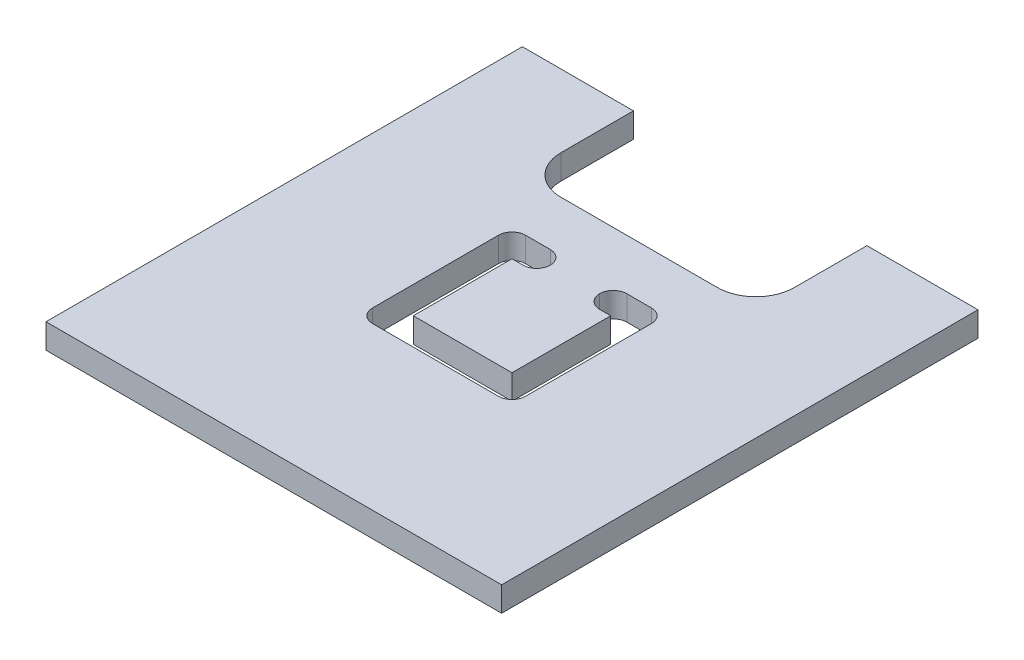
ISO-10303-21;
HEADER;
FILE_DESCRIPTION(('STEP AP214'),'2;1');
FILE_NAME('part.step','',(''),(''),'','','');
FILE_SCHEMA(('AUTOMOTIVE_DESIGN { 1 0 10303 214 1 1 1 1 }'));
ENDSEC;
DATA;
#1=APPLICATION_CONTEXT('core data for automotive mechanical design processes');
#2=APPLICATION_PROTOCOL_DEFINITION('international standard','automotive_design',2000,#1);
#3=PRODUCT_CONTEXT('',#1,'mechanical');
#4=PRODUCT('Part','Part','',(#3));
#5=PRODUCT_RELATED_PRODUCT_CATEGORY('part','',(#4));
#6=PRODUCT_DEFINITION_FORMATION('','',#4);
#7=PRODUCT_DEFINITION_CONTEXT('part definition',#1,'design');
#8=PRODUCT_DEFINITION('design','',#6,#7);
#9=PRODUCT_DEFINITION_SHAPE('','',#8);
#10=(LENGTH_UNIT() NAMED_UNIT(*) SI_UNIT(.MILLI.,.METRE.));
#11=(NAMED_UNIT(*) PLANE_ANGLE_UNIT() SI_UNIT($,.RADIAN.));
#12=(NAMED_UNIT(*) SI_UNIT($,.STERADIAN.) SOLID_ANGLE_UNIT());
#13=UNCERTAINTY_MEASURE_WITH_UNIT(LENGTH_MEASURE(1.E-05),#10,'distance_accuracy_value','');
#14=(GEOMETRIC_REPRESENTATION_CONTEXT(3) GLOBAL_UNCERTAINTY_ASSIGNED_CONTEXT((#13)) GLOBAL_UNIT_ASSIGNED_CONTEXT((#10,
#11,#12)) REPRESENTATION_CONTEXT('',''));
#15=CARTESIAN_POINT('',(0.,0.,0.));
#16=DIRECTION('',(0.,0.,1.));
#17=DIRECTION('',(1.,0.,0.));
#18=AXIS2_PLACEMENT_3D('',#15,#16,#17);
#19=CARTESIAN_POINT('',(-9.23,1.,-9.65));
#20=DIRECTION('',(0.,0.,1.));
#21=DIRECTION('',(1.,0.,0.));
#22=AXIS2_PLACEMENT_3D('',#19,#20,#21);
#23=PLANE('',#22);
#24=DIRECTION('',(-1.,0.,0.));
#25=VECTOR('',#24,1.);
#26=CARTESIAN_POINT('',(-9.23,0.,-9.65));
#27=LINE('',#26,#25);
#28=CARTESIAN_POINT('',(9.23,0.,-9.65));
#29=VERTEX_POINT('',#28);
#30=CARTESIAN_POINT('',(4.72999999999999,0.,-9.65));
#31=VERTEX_POINT('',#30);
#32=EDGE_CURVE('E340',#29,#31,#27,.T.);
#33=ORIENTED_EDGE('',*,*,#32,.T.);
#34=DIRECTION('',(0.,-1.,0.));
#35=VECTOR('',#34,1.);
#36=CARTESIAN_POINT('',(4.72999999999999,1.,-9.65));
#37=LINE('',#36,#35);
#38=CARTESIAN_POINT('',(4.72999999999999,1.,-9.65));
#39=VERTEX_POINT('',#38);
#40=EDGE_CURVE('E319',#39,#31,#37,.T.);
#41=ORIENTED_EDGE('',*,*,#40,.F.);
#42=DIRECTION('',(-1.,0.,0.));
#43=VECTOR('',#42,1.);
#44=CARTESIAN_POINT('',(-9.23,1.,-9.65));
#45=LINE('',#44,#43);
#46=CARTESIAN_POINT('',(9.23,1.,-9.65));
#47=VERTEX_POINT('',#46);
#48=EDGE_CURVE('E329',#47,#39,#45,.T.);
#49=ORIENTED_EDGE('',*,*,#48,.F.);
#50=DIRECTION('',(0.,-1.,0.));
#51=VECTOR('',#50,1.);
#52=CARTESIAN_POINT('',(9.23,1.,-9.65));
#53=LINE('',#52,#51);
#54=EDGE_CURVE('E354',#47,#29,#53,.T.);
#55=ORIENTED_EDGE('',*,*,#54,.T.);
#56=EDGE_LOOP('',(#33,#41,#49,#55));
#57=FACE_BOUND('',#56,.T.);
#58=ADVANCED_FACE('F35',(#57),#23,.F.);
#59=CARTESIAN_POINT('',(9.23,1.,9.65));
#60=DIRECTION('',(-1.,0.,0.));
#61=DIRECTION('',(0.,0.,1.));
#62=AXIS2_PLACEMENT_3D('',#59,#60,#61);
#63=PLANE('',#62);
#64=DIRECTION('',(0.,0.,-1.));
#65=VECTOR('',#64,1.);
#66=CARTESIAN_POINT('',(9.23,0.,9.65));
#67=LINE('',#66,#65);
#68=CARTESIAN_POINT('',(9.23,0.,9.65));
#69=VERTEX_POINT('',#68);
#70=EDGE_CURVE('E321',#69,#29,#67,.T.);
#71=ORIENTED_EDGE('',*,*,#70,.T.);
#72=ORIENTED_EDGE('',*,*,#54,.F.);
#73=DIRECTION('',(0.,0.,-1.));
#74=VECTOR('',#73,1.);
#75=CARTESIAN_POINT('',(9.23,1.,9.65));
#76=LINE('',#75,#74);
#77=CARTESIAN_POINT('',(9.23,1.,9.65));
#78=VERTEX_POINT('',#77);
#79=EDGE_CURVE('E324',#78,#47,#76,.T.);
#80=ORIENTED_EDGE('',*,*,#79,.F.);
#81=DIRECTION('',(0.,-1.,0.));
#82=VECTOR('',#81,1.);
#83=CARTESIAN_POINT('',(9.23,1.,9.65));
#84=LINE('',#83,#82);
#85=EDGE_CURVE('E336',#78,#69,#84,.T.);
#86=ORIENTED_EDGE('',*,*,#85,.T.);
#87=EDGE_LOOP('',(#71,#72,#80,#86));
#88=FACE_BOUND('',#87,.T.);
#89=ADVANCED_FACE('F507',(#88),#63,.F.);
#90=CARTESIAN_POINT('',(-4.72999999999999,1.,-9.65));
#91=VERTEX_POINT('',#90);
#92=CARTESIAN_POINT('',(-9.23,1.,-9.65));
#93=VERTEX_POINT('',#92);
#94=EDGE_CURVE('E327',#91,#93,#45,.T.);
#95=ORIENTED_EDGE('',*,*,#94,.F.);
#96=DIRECTION('',(0.,-1.,0.));
#97=VECTOR('',#96,1.);
#98=CARTESIAN_POINT('',(-4.72999999999999,1.,-9.65));
#99=LINE('',#98,#97);
#100=CARTESIAN_POINT('',(-4.72999999999999,0.,-9.65));
#101=VERTEX_POINT('',#100);
#102=EDGE_CURVE('E312',#91,#101,#99,.T.);
#103=ORIENTED_EDGE('',*,*,#102,.T.);
#104=CARTESIAN_POINT('',(-9.23,0.,-9.65));
#105=VERTEX_POINT('',#104);
#106=EDGE_CURVE('E339',#101,#105,#27,.T.);
#107=ORIENTED_EDGE('',*,*,#106,.T.);
#108=DIRECTION('',(0.,-1.,0.));
#109=VECTOR('',#108,1.);
#110=CARTESIAN_POINT('',(-9.23,1.,-9.65));
#111=LINE('',#110,#109);
#112=EDGE_CURVE('E351',#93,#105,#111,.T.);
#113=ORIENTED_EDGE('',*,*,#112,.F.);
#114=EDGE_LOOP('',(#95,#103,#107,#113));
#115=FACE_BOUND('',#114,.T.);
#116=ADVANCED_FACE('F510',(#115),#23,.F.);
#117=CARTESIAN_POINT('',(-9.23,1.,9.65));
#118=DIRECTION('',(1.,0.,0.));
#119=DIRECTION('',(0.,0.,-1.));
#120=AXIS2_PLACEMENT_3D('',#117,#118,#119);
#121=PLANE('',#120);
#122=DIRECTION('',(0.,0.,1.));
#123=VECTOR('',#122,1.);
#124=CARTESIAN_POINT('',(-9.23,0.,9.65));
#125=LINE('',#124,#123);
#126=CARTESIAN_POINT('',(-9.23,0.,9.65));
#127=VERTEX_POINT('',#126);
#128=EDGE_CURVE('E343',#105,#127,#125,.T.);
#129=ORIENTED_EDGE('',*,*,#128,.T.);
#130=DIRECTION('',(0.,-1.,0.));
#131=VECTOR('',#130,1.);
#132=CARTESIAN_POINT('',(-9.23,1.,9.65));
#133=LINE('',#132,#131);
#134=CARTESIAN_POINT('',(-9.23,1.,9.65));
#135=VERTEX_POINT('',#134);
#136=EDGE_CURVE('E348',#135,#127,#133,.T.);
#137=ORIENTED_EDGE('',*,*,#136,.F.);
#138=DIRECTION('',(0.,0.,1.));
#139=VECTOR('',#138,1.);
#140=CARTESIAN_POINT('',(-9.23,1.,9.65));
#141=LINE('',#140,#139);
#142=EDGE_CURVE('E332',#93,#135,#141,.T.);
#143=ORIENTED_EDGE('',*,*,#142,.F.);
#144=ORIENTED_EDGE('',*,*,#112,.T.);
#145=EDGE_LOOP('',(#129,#137,#143,#144));
#146=FACE_BOUND('',#145,.T.);
#147=ADVANCED_FACE('F518',(#146),#121,.F.);
#148=CARTESIAN_POINT('',(-9.23,1.,9.65));
#149=DIRECTION('',(0.,0.,-1.));
#150=DIRECTION('',(-1.,0.,0.));
#151=AXIS2_PLACEMENT_3D('',#148,#149,#150);
#152=PLANE('',#151);
#153=DIRECTION('',(1.,0.,0.));
#154=VECTOR('',#153,1.);
#155=CARTESIAN_POINT('',(-9.23,0.,9.65));
#156=LINE('',#155,#154);
#157=EDGE_CURVE('E328',#127,#69,#156,.T.);
#158=ORIENTED_EDGE('',*,*,#157,.T.);
#159=ORIENTED_EDGE('',*,*,#85,.F.);
#160=DIRECTION('',(1.,0.,0.));
#161=VECTOR('',#160,1.);
#162=CARTESIAN_POINT('',(-9.23,1.,9.65));
#163=LINE('',#162,#161);
#164=EDGE_CURVE('E334',#135,#78,#163,.T.);
#165=ORIENTED_EDGE('',*,*,#164,.F.);
#166=ORIENTED_EDGE('',*,*,#136,.T.);
#167=EDGE_LOOP('',(#158,#159,#165,#166));
#168=FACE_BOUND('',#167,.T.);
#169=ADVANCED_FACE('F523',(#168),#152,.F.);
#170=CARTESIAN_POINT('',(0.,1.,0.));
#171=DIRECTION('',(0.,-1.,0.));
#172=DIRECTION('',(0.,0.,-1.));
#173=AXIS2_PLACEMENT_3D('',#170,#171,#172);
#174=PLANE('',#173);
#175=DIRECTION('',(0.,0.,1.));
#176=VECTOR('',#175,1.);
#177=CARTESIAN_POINT('',(2.,1.,2.));
#178=LINE('',#177,#176);
#179=CARTESIAN_POINT('',(2.,1.,-2.));
#180=VERTEX_POINT('',#179);
#181=CARTESIAN_POINT('',(2.,1.,2.));
#182=VERTEX_POINT('',#181);
#183=EDGE_CURVE('E271',#180,#182,#178,.T.);
#184=ORIENTED_EDGE('',*,*,#183,.F.);
#185=DIRECTION('',(1.,0.,0.));
#186=VECTOR('',#185,1.);
#187=CARTESIAN_POINT('',(2.,1.,-2.));
#188=LINE('',#187,#186);
#189=CARTESIAN_POINT('',(1.55,1.,-2.));
#190=VERTEX_POINT('',#189);
#191=EDGE_CURVE('E238',#190,#180,#188,.T.);
#192=ORIENTED_EDGE('',*,*,#191,.F.);
#193=CARTESIAN_POINT('',(1.55,1.,-2.55));
#194=DIRECTION('',(0.,-1.,0.));
#195=DIRECTION('',(0.,0.,-1.));
#196=AXIS2_PLACEMENT_3D('',#193,#194,#195);
#197=CIRCLE('',#196,0.55);
#198=CARTESIAN_POINT('',(1.,1.,-2.55));
#199=VERTEX_POINT('',#198);
#200=EDGE_CURVE('E60',#190,#199,#197,.T.);
#201=ORIENTED_EDGE('',*,*,#200,.T.);
#202=CARTESIAN_POINT('',(1.55,1.,-2.55));
#203=DIRECTION('',(0.,-1.,0.));
#204=DIRECTION('',(0.,0.,-1.));
#205=AXIS2_PLACEMENT_3D('',#202,#203,#204);
#206=CIRCLE('',#205,0.55);
#207=CARTESIAN_POINT('',(1.55,1.,-3.1));
#208=VERTEX_POINT('',#207);
#209=EDGE_CURVE('E422',#199,#208,#206,.T.);
#210=ORIENTED_EDGE('',*,*,#209,.T.);
#211=DIRECTION('',(-1.,0.,0.));
#212=VECTOR('',#211,1.);
#213=CARTESIAN_POINT('',(1.,1.,-3.1));
#214=LINE('',#213,#212);
#215=CARTESIAN_POINT('',(2.55,1.,-3.1));
#216=VERTEX_POINT('',#215);
#217=EDGE_CURVE('E233',#216,#208,#214,.T.);
#218=ORIENTED_EDGE('',*,*,#217,.F.);
#219=CARTESIAN_POINT('',(2.55,1.,-2.55));
#220=DIRECTION('',(0.,-1.,0.));
#221=DIRECTION('',(0.,0.,-1.));
#222=AXIS2_PLACEMENT_3D('',#219,#220,#221);
#223=CIRCLE('',#222,0.55);
#224=CARTESIAN_POINT('',(3.1,1.,-2.55));
#225=VERTEX_POINT('',#224);
#226=EDGE_CURVE('E425',#216,#225,#223,.T.);
#227=ORIENTED_EDGE('',*,*,#226,.T.);
#228=DIRECTION('',(0.,0.,-1.));
#229=VECTOR('',#228,1.);
#230=CARTESIAN_POINT('',(3.1,1.,3.1));
#231=LINE('',#230,#229);
#232=CARTESIAN_POINT('',(3.1,1.,2.55));
#233=VERTEX_POINT('',#232);
#234=EDGE_CURVE('E292',#233,#225,#231,.T.);
#235=ORIENTED_EDGE('',*,*,#234,.F.);
#236=CARTESIAN_POINT('',(2.55,1.,2.55));
#237=DIRECTION('',(0.,-1.,0.));
#238=DIRECTION('',(0.,0.,-1.));
#239=AXIS2_PLACEMENT_3D('',#236,#237,#238);
#240=CIRCLE('',#239,0.55);
#241=CARTESIAN_POINT('',(2.55,1.,3.1));
#242=VERTEX_POINT('',#241);
#243=EDGE_CURVE('E44',#233,#242,#240,.T.);
#244=ORIENTED_EDGE('',*,*,#243,.T.);
#245=DIRECTION('',(1.,0.,0.));
#246=VECTOR('',#245,1.);
#247=CARTESIAN_POINT('',(-3.1,1.,3.1));
#248=LINE('',#247,#246);
#249=CARTESIAN_POINT('',(-2.55,1.,3.1));
#250=VERTEX_POINT('',#249);
#251=EDGE_CURVE('E289',#250,#242,#248,.T.);
#252=ORIENTED_EDGE('',*,*,#251,.F.);
#253=CARTESIAN_POINT('',(-2.55,1.,2.55));
#254=DIRECTION('',(0.,-1.,0.));
#255=DIRECTION('',(0.,0.,-1.));
#256=AXIS2_PLACEMENT_3D('',#253,#254,#255);
#257=CIRCLE('',#256,0.55);
#258=CARTESIAN_POINT('',(-3.1,1.,2.55));
#259=VERTEX_POINT('',#258);
#260=EDGE_CURVE('E410',#250,#259,#257,.T.);
#261=ORIENTED_EDGE('',*,*,#260,.T.);
#262=DIRECTION('',(0.,0.,1.));
#263=VECTOR('',#262,1.);
#264=CARTESIAN_POINT('',(-3.1,1.,3.1));
#265=LINE('',#264,#263);
#266=CARTESIAN_POINT('',(-3.1,1.,-2.55));
#267=VERTEX_POINT('',#266);
#268=EDGE_CURVE('E286',#267,#259,#265,.T.);
#269=ORIENTED_EDGE('',*,*,#268,.F.);
#270=CARTESIAN_POINT('',(-2.55,1.,-2.55));
#271=DIRECTION('',(0.,-1.,0.));
#272=DIRECTION('',(0.,0.,-1.));
#273=AXIS2_PLACEMENT_3D('',#270,#271,#272);
#274=CIRCLE('',#273,0.55);
#275=CARTESIAN_POINT('',(-2.55,1.,-3.1));
#276=VERTEX_POINT('',#275);
#277=EDGE_CURVE('E418',#267,#276,#274,.T.);
#278=ORIENTED_EDGE('',*,*,#277,.T.);
#279=DIRECTION('',(-1.,0.,0.));
#280=VECTOR('',#279,1.);
#281=CARTESIAN_POINT('',(-3.1,1.,-3.1));
#282=LINE('',#281,#280);
#283=CARTESIAN_POINT('',(-1.55,1.,-3.1));
#284=VERTEX_POINT('',#283);
#285=EDGE_CURVE('E283',#284,#276,#282,.T.);
#286=ORIENTED_EDGE('',*,*,#285,.F.);
#287=CARTESIAN_POINT('',(-1.55,1.,-2.55));
#288=DIRECTION('',(0.,-1.,0.));
#289=DIRECTION('',(0.,0.,-1.));
#290=AXIS2_PLACEMENT_3D('',#287,#288,#289);
#291=CIRCLE('',#290,0.55);
#292=CARTESIAN_POINT('',(-1.,1.,-2.55));
#293=VERTEX_POINT('',#292);
#294=EDGE_CURVE('E414',#284,#293,#291,.T.);
#295=ORIENTED_EDGE('',*,*,#294,.T.);
#296=CARTESIAN_POINT('',(-1.55,1.,-2.55));
#297=DIRECTION('',(0.,-1.,0.));
#298=DIRECTION('',(0.,0.,-1.));
#299=AXIS2_PLACEMENT_3D('',#296,#297,#298);
#300=CIRCLE('',#299,0.55);
#301=CARTESIAN_POINT('',(-1.55,1.,-2.));
#302=VERTEX_POINT('',#301);
#303=EDGE_CURVE('E404',#293,#302,#300,.T.);
#304=ORIENTED_EDGE('',*,*,#303,.T.);
#305=DIRECTION('',(1.,0.,0.));
#306=VECTOR('',#305,1.);
#307=CARTESIAN_POINT('',(-2.,1.,-2.));
#308=LINE('',#307,#306);
#309=CARTESIAN_POINT('',(-2.,1.,-2.));
#310=VERTEX_POINT('',#309);
#311=EDGE_CURVE('E280',#310,#302,#308,.T.);
#312=ORIENTED_EDGE('',*,*,#311,.F.);
#313=DIRECTION('',(0.,0.,-1.));
#314=VECTOR('',#313,1.);
#315=CARTESIAN_POINT('',(-2.,1.,2.));
#316=LINE('',#315,#314);
#317=CARTESIAN_POINT('',(-2.,1.,2.));
#318=VERTEX_POINT('',#317);
#319=EDGE_CURVE('E277',#318,#310,#316,.T.);
#320=ORIENTED_EDGE('',*,*,#319,.F.);
#321=DIRECTION('',(-1.,0.,0.));
#322=VECTOR('',#321,1.);
#323=CARTESIAN_POINT('',(-2.,1.,2.));
#324=LINE('',#323,#322);
#325=EDGE_CURVE('E274',#182,#318,#324,.T.);
#326=ORIENTED_EDGE('',*,*,#325,.F.);
#327=EDGE_LOOP('',(#184,#192,#201,#210,#218,#227,#235,#244,#252,#261,#269,#278,#286,#295,#304,
#312,#320,#326));
#328=FACE_BOUND('',#327,.T.);
#329=ORIENTED_EDGE('',*,*,#48,.T.);
#330=DIRECTION('',(0.,0.,1.));
#331=VECTOR('',#330,1.);
#332=CARTESIAN_POINT('',(4.72999999999999,1.,-9.65));
#333=LINE('',#332,#331);
#334=CARTESIAN_POINT('',(4.73,1.,-6.70999999999988));
#335=VERTEX_POINT('',#334);
#336=EDGE_CURVE('E303',#39,#335,#333,.T.);
#337=ORIENTED_EDGE('',*,*,#336,.T.);
#338=CARTESIAN_POINT('',(3.17,1.,-6.70999999999988));
#339=DIRECTION('',(0.,-1.,0.));
#340=DIRECTION('',(0.,0.,-1.));
#341=AXIS2_PLACEMENT_3D('',#338,#339,#340);
#342=CIRCLE('',#341,1.56);
#343=CARTESIAN_POINT('',(3.17,1.,-5.14999999999988));
#344=VERTEX_POINT('',#343);
#345=EDGE_CURVE('E373',#335,#344,#342,.T.);
#346=ORIENTED_EDGE('',*,*,#345,.T.);
#347=DIRECTION('',(-1.,0.,0.));
#348=VECTOR('',#347,1.);
#349=CARTESIAN_POINT('',(4.73,1.,-5.14999999999988));
#350=LINE('',#349,#348);
#351=CARTESIAN_POINT('',(-3.16999999999998,1.,-5.14999999999988));
#352=VERTEX_POINT('',#351);
#353=EDGE_CURVE('E306',#344,#352,#350,.T.);
#354=ORIENTED_EDGE('',*,*,#353,.T.);
#355=CARTESIAN_POINT('',(-3.16999999999998,1.,-6.70999999999988));
#356=DIRECTION('',(0.,-1.,0.));
#357=DIRECTION('',(0.,0.,-1.));
#358=AXIS2_PLACEMENT_3D('',#355,#356,#357);
#359=CIRCLE('',#358,1.56);
#360=CARTESIAN_POINT('',(-4.72999999999998,1.,-6.70999999999988));
#361=VERTEX_POINT('',#360);
#362=EDGE_CURVE('E369',#352,#361,#359,.T.);
#363=ORIENTED_EDGE('',*,*,#362,.T.);
#364=DIRECTION('',(0.,0.,-1.));
#365=VECTOR('',#364,1.);
#366=CARTESIAN_POINT('',(-4.72999999999999,1.,-9.65));
#367=LINE('',#366,#365);
#368=EDGE_CURVE('E310',#361,#91,#367,.T.);
#369=ORIENTED_EDGE('',*,*,#368,.T.);
#370=ORIENTED_EDGE('',*,*,#94,.T.);
#371=ORIENTED_EDGE('',*,*,#142,.T.);
#372=ORIENTED_EDGE('',*,*,#164,.T.);
#373=ORIENTED_EDGE('',*,*,#79,.T.);
#374=EDGE_LOOP('',(#329,#337,#346,#354,#363,#369,#370,#371,#372,#373));
#375=FACE_BOUND('',#374,.T.);
#376=ADVANCED_FACE('F440',(#328,#375),#174,.F.);
#377=CARTESIAN_POINT('',(0.,0.,0.));
#378=DIRECTION('',(0.,-1.,0.));
#379=DIRECTION('',(0.,0.,-1.));
#380=AXIS2_PLACEMENT_3D('',#377,#378,#379);
#381=PLANE('',#380);
#382=DIRECTION('',(-1.,0.,0.));
#383=VECTOR('',#382,1.);
#384=CARTESIAN_POINT('',(1.,0.,-3.1));
#385=LINE('',#384,#383);
#386=CARTESIAN_POINT('',(2.55,0.,-3.1));
#387=VERTEX_POINT('',#386);
#388=CARTESIAN_POINT('',(1.55,0.,-3.1));
#389=VERTEX_POINT('',#388);
#390=EDGE_CURVE('E243',#387,#389,#385,.T.);
#391=ORIENTED_EDGE('',*,*,#390,.T.);
#392=CARTESIAN_POINT('',(1.55,0.,-2.55));
#393=DIRECTION('',(0.,-1.,0.));
#394=DIRECTION('',(0.,0.,-1.));
#395=AXIS2_PLACEMENT_3D('',#392,#393,#394);
#396=CIRCLE('',#395,0.55);
#397=CARTESIAN_POINT('',(1.,0.,-2.55));
#398=VERTEX_POINT('',#397);
#399=EDGE_CURVE('E52',#389,#398,#396,.F.);
#400=ORIENTED_EDGE('',*,*,#399,.T.);
#401=CARTESIAN_POINT('',(1.55,0.,-2.55));
#402=DIRECTION('',(0.,-1.,0.));
#403=DIRECTION('',(0.,0.,-1.));
#404=AXIS2_PLACEMENT_3D('',#401,#402,#403);
#405=CIRCLE('',#404,0.55);
#406=CARTESIAN_POINT('',(1.55,0.,-2.));
#407=VERTEX_POINT('',#406);
#408=EDGE_CURVE('E229',#398,#407,#405,.F.);
#409=ORIENTED_EDGE('',*,*,#408,.T.);
#410=DIRECTION('',(1.,0.,0.));
#411=VECTOR('',#410,1.);
#412=CARTESIAN_POINT('',(2.,0.,-2.));
#413=LINE('',#412,#411);
#414=CARTESIAN_POINT('',(2.,0.,-2.));
#415=VERTEX_POINT('',#414);
#416=EDGE_CURVE('E221',#407,#415,#413,.T.);
#417=ORIENTED_EDGE('',*,*,#416,.T.);
#418=DIRECTION('',(0.,0.,1.));
#419=VECTOR('',#418,1.);
#420=CARTESIAN_POINT('',(2.,0.,2.));
#421=LINE('',#420,#419);
#422=CARTESIAN_POINT('',(2.,0.,2.));
#423=VERTEX_POINT('',#422);
#424=EDGE_CURVE('E227',#415,#423,#421,.T.);
#425=ORIENTED_EDGE('',*,*,#424,.T.);
#426=DIRECTION('',(-1.,0.,0.));
#427=VECTOR('',#426,1.);
#428=CARTESIAN_POINT('',(-2.,0.,2.));
#429=LINE('',#428,#427);
#430=CARTESIAN_POINT('',(-2.,0.,2.));
#431=VERTEX_POINT('',#430);
#432=EDGE_CURVE('E247',#423,#431,#429,.T.);
#433=ORIENTED_EDGE('',*,*,#432,.T.);
#434=DIRECTION('',(0.,0.,-1.));
#435=VECTOR('',#434,1.);
#436=CARTESIAN_POINT('',(-2.,0.,2.));
#437=LINE('',#436,#435);
#438=CARTESIAN_POINT('',(-2.,0.,-2.));
#439=VERTEX_POINT('',#438);
#440=EDGE_CURVE('E249',#431,#439,#437,.T.);
#441=ORIENTED_EDGE('',*,*,#440,.T.);
#442=DIRECTION('',(1.,0.,0.));
#443=VECTOR('',#442,1.);
#444=CARTESIAN_POINT('',(-2.,0.,-2.));
#445=LINE('',#444,#443);
#446=CARTESIAN_POINT('',(-1.55,0.,-2.));
#447=VERTEX_POINT('',#446);
#448=EDGE_CURVE('E254',#439,#447,#445,.T.);
#449=ORIENTED_EDGE('',*,*,#448,.T.);
#450=CARTESIAN_POINT('',(-1.55,0.,-2.55));
#451=DIRECTION('',(0.,-1.,0.));
#452=DIRECTION('',(0.,0.,-1.));
#453=AXIS2_PLACEMENT_3D('',#450,#451,#452);
#454=CIRCLE('',#453,0.55);
#455=CARTESIAN_POINT('',(-1.,0.,-2.55));
#456=VERTEX_POINT('',#455);
#457=EDGE_CURVE('E406',#447,#456,#454,.F.);
#458=ORIENTED_EDGE('',*,*,#457,.T.);
#459=CARTESIAN_POINT('',(-1.55,0.,-2.55));
#460=DIRECTION('',(0.,-1.,0.));
#461=DIRECTION('',(0.,0.,-1.));
#462=AXIS2_PLACEMENT_3D('',#459,#460,#461);
#463=CIRCLE('',#462,0.55);
#464=CARTESIAN_POINT('',(-1.55,0.,-3.1));
#465=VERTEX_POINT('',#464);
#466=EDGE_CURVE('E416',#456,#465,#463,.F.);
#467=ORIENTED_EDGE('',*,*,#466,.T.);
#468=DIRECTION('',(-1.,0.,0.));
#469=VECTOR('',#468,1.);
#470=CARTESIAN_POINT('',(-3.1,0.,-3.1));
#471=LINE('',#470,#469);
#472=CARTESIAN_POINT('',(-2.55,0.,-3.1));
#473=VERTEX_POINT('',#472);
#474=EDGE_CURVE('E257',#465,#473,#471,.T.);
#475=ORIENTED_EDGE('',*,*,#474,.T.);
#476=CARTESIAN_POINT('',(-2.55,0.,-2.55));
#477=DIRECTION('',(0.,-1.,0.));
#478=DIRECTION('',(0.,0.,-1.));
#479=AXIS2_PLACEMENT_3D('',#476,#477,#478);
#480=CIRCLE('',#479,0.55);
#481=CARTESIAN_POINT('',(-3.1,0.,-2.55));
#482=VERTEX_POINT('',#481);
#483=EDGE_CURVE('E420',#473,#482,#480,.F.);
#484=ORIENTED_EDGE('',*,*,#483,.T.);
#485=DIRECTION('',(0.,0.,1.));
#486=VECTOR('',#485,1.);
#487=CARTESIAN_POINT('',(-3.1,0.,3.1));
#488=LINE('',#487,#486);
#489=CARTESIAN_POINT('',(-3.1,0.,2.55));
#490=VERTEX_POINT('',#489);
#491=EDGE_CURVE('E260',#482,#490,#488,.T.);
#492=ORIENTED_EDGE('',*,*,#491,.T.);
#493=CARTESIAN_POINT('',(-2.55,0.,2.55));
#494=DIRECTION('',(0.,-1.,0.));
#495=DIRECTION('',(0.,0.,-1.));
#496=AXIS2_PLACEMENT_3D('',#493,#494,#495);
#497=CIRCLE('',#496,0.55);
#498=CARTESIAN_POINT('',(-2.55,0.,3.1));
#499=VERTEX_POINT('',#498);
#500=EDGE_CURVE('E412',#490,#499,#497,.F.);
#501=ORIENTED_EDGE('',*,*,#500,.T.);
#502=DIRECTION('',(1.,0.,0.));
#503=VECTOR('',#502,1.);
#504=CARTESIAN_POINT('',(-3.1,0.,3.1));
#505=LINE('',#504,#503);
#506=CARTESIAN_POINT('',(2.55,0.,3.1));
#507=VERTEX_POINT('',#506);
#508=EDGE_CURVE('E263',#499,#507,#505,.T.);
#509=ORIENTED_EDGE('',*,*,#508,.T.);
#510=CARTESIAN_POINT('',(2.55,0.,2.55));
#511=DIRECTION('',(0.,-1.,0.));
#512=DIRECTION('',(0.,0.,-1.));
#513=AXIS2_PLACEMENT_3D('',#510,#511,#512);
#514=CIRCLE('',#513,0.55);
#515=CARTESIAN_POINT('',(3.1,0.,2.55));
#516=VERTEX_POINT('',#515);
#517=EDGE_CURVE('E11',#507,#516,#514,.F.);
#518=ORIENTED_EDGE('',*,*,#517,.T.);
#519=DIRECTION('',(0.,0.,-1.));
#520=VECTOR('',#519,1.);
#521=CARTESIAN_POINT('',(3.1,0.,3.1));
#522=LINE('',#521,#520);
#523=CARTESIAN_POINT('',(3.1,0.,-2.55));
#524=VERTEX_POINT('',#523);
#525=EDGE_CURVE('E266',#516,#524,#522,.T.);
#526=ORIENTED_EDGE('',*,*,#525,.T.);
#527=CARTESIAN_POINT('',(2.55,0.,-2.55));
#528=DIRECTION('',(0.,-1.,0.));
#529=DIRECTION('',(0.,0.,-1.));
#530=AXIS2_PLACEMENT_3D('',#527,#528,#529);
#531=CIRCLE('',#530,0.55);
#532=EDGE_CURVE('E427',#524,#387,#531,.F.);
#533=ORIENTED_EDGE('',*,*,#532,.T.);
#534=EDGE_LOOP('',(#391,#400,#409,#417,#425,#433,#441,#449,#458,#467,#475,#484,#492,#501,#509,
#518,#526,#533));
#535=FACE_BOUND('',#534,.T.);
#536=DIRECTION('',(0.,0.,1.));
#537=VECTOR('',#536,1.);
#538=CARTESIAN_POINT('',(4.72999999999999,0.,-9.65));
#539=LINE('',#538,#537);
#540=CARTESIAN_POINT('',(4.73,0.,-6.70999999999988));
#541=VERTEX_POINT('',#540);
#542=EDGE_CURVE('E299',#31,#541,#539,.T.);
#543=ORIENTED_EDGE('',*,*,#542,.F.);
#544=ORIENTED_EDGE('',*,*,#32,.F.);
#545=ORIENTED_EDGE('',*,*,#70,.F.);
#546=ORIENTED_EDGE('',*,*,#157,.F.);
#547=ORIENTED_EDGE('',*,*,#128,.F.);
#548=ORIENTED_EDGE('',*,*,#106,.F.);
#549=DIRECTION('',(0.,0.,-1.));
#550=VECTOR('',#549,1.);
#551=CARTESIAN_POINT('',(-4.72999999999999,0.,-9.65));
#552=LINE('',#551,#550);
#553=CARTESIAN_POINT('',(-4.72999999999998,0.,-6.70999999999988));
#554=VERTEX_POINT('',#553);
#555=EDGE_CURVE('E307',#554,#101,#552,.T.);
#556=ORIENTED_EDGE('',*,*,#555,.F.);
#557=CARTESIAN_POINT('',(-3.16999999999998,0.,-6.70999999999988));
#558=DIRECTION('',(0.,-1.,0.));
#559=DIRECTION('',(0.,0.,-1.));
#560=AXIS2_PLACEMENT_3D('',#557,#558,#559);
#561=CIRCLE('',#560,1.56);
#562=CARTESIAN_POINT('',(-3.16999999999998,0.,-5.14999999999988));
#563=VERTEX_POINT('',#562);
#564=EDGE_CURVE('E367',#554,#563,#561,.F.);
#565=ORIENTED_EDGE('',*,*,#564,.T.);
#566=DIRECTION('',(-1.,0.,0.));
#567=VECTOR('',#566,1.);
#568=CARTESIAN_POINT('',(4.73,0.,-5.14999999999988));
#569=LINE('',#568,#567);
#570=CARTESIAN_POINT('',(3.17,0.,-5.14999999999988));
#571=VERTEX_POINT('',#570);
#572=EDGE_CURVE('E315',#571,#563,#569,.T.);
#573=ORIENTED_EDGE('',*,*,#572,.F.);
#574=CARTESIAN_POINT('',(3.17,0.,-6.70999999999988));
#575=DIRECTION('',(0.,-1.,0.));
#576=DIRECTION('',(0.,0.,-1.));
#577=AXIS2_PLACEMENT_3D('',#574,#575,#576);
#578=CIRCLE('',#577,1.56);
#579=EDGE_CURVE('E371',#571,#541,#578,.F.);
#580=ORIENTED_EDGE('',*,*,#579,.T.);
#581=EDGE_LOOP('',(#543,#544,#545,#546,#547,#548,#556,#565,#573,#580));
#582=FACE_BOUND('',#581,.T.);
#583=ADVANCED_FACE('F223',(#535,#582),#381,.T.);
#584=CARTESIAN_POINT('',(4.72999999999999,1.,-9.65));
#585=DIRECTION('',(1.,0.,0.));
#586=DIRECTION('',(0.,0.,-1.));
#587=AXIS2_PLACEMENT_3D('',#584,#585,#586);
#588=PLANE('',#587);
#589=ORIENTED_EDGE('',*,*,#542,.T.);
#590=DIRECTION('',(0.,-1.,0.));
#591=VECTOR('',#590,1.);
#592=CARTESIAN_POINT('',(4.73,1.,-6.70999999999988));
#593=LINE('',#592,#591);
#594=EDGE_CURVE('E365',#541,#335,#593,.F.);
#595=ORIENTED_EDGE('',*,*,#594,.T.);
#596=ORIENTED_EDGE('',*,*,#336,.F.);
#597=ORIENTED_EDGE('',*,*,#40,.T.);
#598=EDGE_LOOP('',(#589,#595,#596,#597));
#599=FACE_BOUND('',#598,.T.);
#600=ADVANCED_FACE('F549',(#599),#588,.F.);
#601=CARTESIAN_POINT('',(-4.72999999999999,1.,-9.65));
#602=DIRECTION('',(-1.,0.,0.));
#603=DIRECTION('',(0.,0.,1.));
#604=AXIS2_PLACEMENT_3D('',#601,#602,#603);
#605=PLANE('',#604);
#606=ORIENTED_EDGE('',*,*,#368,.F.);
#607=DIRECTION('',(0.,-1.,0.));
#608=VECTOR('',#607,1.);
#609=CARTESIAN_POINT('',(-4.72999999999998,0.,-6.70999999999988));
#610=LINE('',#609,#608);
#611=EDGE_CURVE('E357',#361,#554,#610,.T.);
#612=ORIENTED_EDGE('',*,*,#611,.T.);
#613=ORIENTED_EDGE('',*,*,#555,.T.);
#614=ORIENTED_EDGE('',*,*,#102,.F.);
#615=EDGE_LOOP('',(#606,#612,#613,#614));
#616=FACE_BOUND('',#615,.T.);
#617=ADVANCED_FACE('F535',(#616),#605,.F.);
#618=CARTESIAN_POINT('',(4.73,1.,-5.14999999999988));
#619=DIRECTION('',(0.,0.,1.));
#620=DIRECTION('',(1.,0.,0.));
#621=AXIS2_PLACEMENT_3D('',#618,#619,#620);
#622=PLANE('',#621);
#623=ORIENTED_EDGE('',*,*,#572,.T.);
#624=DIRECTION('',(0.,-1.,0.));
#625=VECTOR('',#624,1.);
#626=CARTESIAN_POINT('',(-3.16999999999998,1.,-5.14999999999988));
#627=LINE('',#626,#625);
#628=EDGE_CURVE('E363',#563,#352,#627,.F.);
#629=ORIENTED_EDGE('',*,*,#628,.T.);
#630=ORIENTED_EDGE('',*,*,#353,.F.);
#631=DIRECTION('',(0.,-1.,0.));
#632=VECTOR('',#631,1.);
#633=CARTESIAN_POINT('',(3.17,0.,-5.14999999999988));
#634=LINE('',#633,#632);
#635=EDGE_CURVE('E360',#344,#571,#634,.T.);
#636=ORIENTED_EDGE('',*,*,#635,.T.);
#637=EDGE_LOOP('',(#623,#629,#630,#636));
#638=FACE_BOUND('',#637,.T.);
#639=ADVANCED_FACE('F557',(#638),#622,.F.);
#640=CARTESIAN_POINT('',(-3.16999999999998,1.,-6.70999999999988));
#641=DIRECTION('',(0.,1.,0.));
#642=DIRECTION('',(0.,0.,1.));
#643=AXIS2_PLACEMENT_3D('',#640,#641,#642);
#644=CYLINDRICAL_SURFACE('',#643,1.56);
#645=ORIENTED_EDGE('',*,*,#362,.F.);
#646=ORIENTED_EDGE('',*,*,#628,.F.);
#647=ORIENTED_EDGE('',*,*,#564,.F.);
#648=ORIENTED_EDGE('',*,*,#611,.F.);
#649=EDGE_LOOP('',(#645,#646,#647,#648));
#650=FACE_BOUND('',#649,.T.);
#651=ADVANCED_FACE('F560',(#650),#644,.F.);
#652=CARTESIAN_POINT('',(3.17,1.,-6.70999999999988));
#653=DIRECTION('',(0.,1.,0.));
#654=DIRECTION('',(0.,0.,1.));
#655=AXIS2_PLACEMENT_3D('',#652,#653,#654);
#656=CYLINDRICAL_SURFACE('',#655,1.56);
#657=ORIENTED_EDGE('',*,*,#345,.F.);
#658=ORIENTED_EDGE('',*,*,#594,.F.);
#659=ORIENTED_EDGE('',*,*,#579,.F.);
#660=ORIENTED_EDGE('',*,*,#635,.F.);
#661=EDGE_LOOP('',(#657,#658,#659,#660));
#662=FACE_BOUND('',#661,.T.);
#663=ADVANCED_FACE('F554',(#662),#656,.F.);
#664=CARTESIAN_POINT('',(2.,0.,-2.));
#665=DIRECTION('',(0.,0.,1.));
#666=DIRECTION('',(1.,0.,0.));
#667=AXIS2_PLACEMENT_3D('',#664,#665,#666);
#668=PLANE('',#667);
#669=ORIENTED_EDGE('',*,*,#416,.F.);
#670=DIRECTION('',(0.,1.,0.));
#671=VECTOR('',#670,1.);
#672=CARTESIAN_POINT('',(1.55,1.,-2.));
#673=LINE('',#672,#671);
#674=EDGE_CURVE('E378',#407,#190,#673,.T.);
#675=ORIENTED_EDGE('',*,*,#674,.T.);
#676=ORIENTED_EDGE('',*,*,#191,.T.);
#677=DIRECTION('',(0.,1.,0.));
#678=VECTOR('',#677,1.);
#679=CARTESIAN_POINT('',(2.,0.,-2.));
#680=LINE('',#679,#678);
#681=EDGE_CURVE('E236',#415,#180,#680,.T.);
#682=ORIENTED_EDGE('',*,*,#681,.F.);
#683=EDGE_LOOP('',(#669,#675,#676,#682));
#684=FACE_BOUND('',#683,.T.);
#685=ADVANCED_FACE('F237',(#684),#668,.F.);
#686=CARTESIAN_POINT('',(1.,0.,-3.1));
#687=DIRECTION('',(0.,0.,-1.));
#688=DIRECTION('',(-1.,0.,0.));
#689=AXIS2_PLACEMENT_3D('',#686,#687,#688);
#690=PLANE('',#689);
#691=ORIENTED_EDGE('',*,*,#217,.T.);
#692=DIRECTION('',(0.,1.,0.));
#693=VECTOR('',#692,1.);
#694=CARTESIAN_POINT('',(1.55,0.,-3.1));
#695=LINE('',#694,#693);
#696=EDGE_CURVE('E397',#208,#389,#695,.F.);
#697=ORIENTED_EDGE('',*,*,#696,.T.);
#698=ORIENTED_EDGE('',*,*,#390,.F.);
#699=DIRECTION('',(0.,1.,0.));
#700=VECTOR('',#699,1.);
#701=CARTESIAN_POINT('',(2.55,1.,-3.1));
#702=LINE('',#701,#700);
#703=EDGE_CURVE('E394',#387,#216,#702,.T.);
#704=ORIENTED_EDGE('',*,*,#703,.T.);
#705=EDGE_LOOP('',(#691,#697,#698,#704));
#706=FACE_BOUND('',#705,.T.);
#707=ADVANCED_FACE('F443',(#706),#690,.F.);
#708=CARTESIAN_POINT('',(3.1,0.,3.1));
#709=DIRECTION('',(1.,0.,0.));
#710=DIRECTION('',(0.,0.,-1.));
#711=AXIS2_PLACEMENT_3D('',#708,#709,#710);
#712=PLANE('',#711);
#713=ORIENTED_EDGE('',*,*,#234,.T.);
#714=DIRECTION('',(0.,1.,0.));
#715=VECTOR('',#714,1.);
#716=CARTESIAN_POINT('',(3.1,0.,-2.55));
#717=LINE('',#716,#715);
#718=EDGE_CURVE('E402',#225,#524,#717,.F.);
#719=ORIENTED_EDGE('',*,*,#718,.T.);
#720=ORIENTED_EDGE('',*,*,#525,.F.);
#721=DIRECTION('',(0.,1.,0.));
#722=VECTOR('',#721,1.);
#723=CARTESIAN_POINT('',(3.1,1.,2.55));
#724=LINE('',#723,#722);
#725=EDGE_CURVE('E399',#516,#233,#724,.T.);
#726=ORIENTED_EDGE('',*,*,#725,.T.);
#727=EDGE_LOOP('',(#713,#719,#720,#726));
#728=FACE_BOUND('',#727,.T.);
#729=ADVANCED_FACE('F452',(#728),#712,.F.);
#730=CARTESIAN_POINT('',(-3.1,0.,3.1));
#731=DIRECTION('',(0.,0.,1.));
#732=DIRECTION('',(1.,0.,0.));
#733=AXIS2_PLACEMENT_3D('',#730,#731,#732);
#734=PLANE('',#733);
#735=ORIENTED_EDGE('',*,*,#508,.F.);
#736=DIRECTION('',(0.,1.,0.));
#737=VECTOR('',#736,1.);
#738=CARTESIAN_POINT('',(-2.55,1.,3.1));
#739=LINE('',#738,#737);
#740=EDGE_CURVE('E382',#499,#250,#739,.T.);
#741=ORIENTED_EDGE('',*,*,#740,.T.);
#742=ORIENTED_EDGE('',*,*,#251,.T.);
#743=DIRECTION('',(0.,1.,0.));
#744=VECTOR('',#743,1.);
#745=CARTESIAN_POINT('',(2.55,0.,3.1));
#746=LINE('',#745,#744);
#747=EDGE_CURVE('E380',#242,#507,#746,.F.);
#748=ORIENTED_EDGE('',*,*,#747,.T.);
#749=EDGE_LOOP('',(#735,#741,#742,#748));
#750=FACE_BOUND('',#749,.T.);
#751=ADVANCED_FACE('F461',(#750),#734,.F.);
#752=CARTESIAN_POINT('',(-3.1,0.,3.1));
#753=DIRECTION('',(-1.,0.,0.));
#754=DIRECTION('',(0.,0.,1.));
#755=AXIS2_PLACEMENT_3D('',#752,#753,#754);
#756=PLANE('',#755);
#757=ORIENTED_EDGE('',*,*,#268,.T.);
#758=DIRECTION('',(0.,1.,0.));
#759=VECTOR('',#758,1.);
#760=CARTESIAN_POINT('',(-3.1,0.,2.55));
#761=LINE('',#760,#759);
#762=EDGE_CURVE('E388',#259,#490,#761,.F.);
#763=ORIENTED_EDGE('',*,*,#762,.T.);
#764=ORIENTED_EDGE('',*,*,#491,.F.);
#765=DIRECTION('',(0.,1.,0.));
#766=VECTOR('',#765,1.);
#767=CARTESIAN_POINT('',(-3.1,1.,-2.55));
#768=LINE('',#767,#766);
#769=EDGE_CURVE('E385',#482,#267,#768,.T.);
#770=ORIENTED_EDGE('',*,*,#769,.T.);
#771=EDGE_LOOP('',(#757,#763,#764,#770));
#772=FACE_BOUND('',#771,.T.);
#773=ADVANCED_FACE('F469',(#772),#756,.F.);
#774=CARTESIAN_POINT('',(-3.1,0.,-3.1));
#775=DIRECTION('',(0.,0.,-1.));
#776=DIRECTION('',(-1.,0.,0.));
#777=AXIS2_PLACEMENT_3D('',#774,#775,#776);
#778=PLANE('',#777);
#779=ORIENTED_EDGE('',*,*,#474,.F.);
#780=DIRECTION('',(0.,1.,0.));
#781=VECTOR('',#780,1.);
#782=CARTESIAN_POINT('',(-1.55,1.,-3.1));
#783=LINE('',#782,#781);
#784=EDGE_CURVE('E392',#465,#284,#783,.T.);
#785=ORIENTED_EDGE('',*,*,#784,.T.);
#786=ORIENTED_EDGE('',*,*,#285,.T.);
#787=DIRECTION('',(0.,1.,0.));
#788=VECTOR('',#787,1.);
#789=CARTESIAN_POINT('',(-2.55,0.,-3.1));
#790=LINE('',#789,#788);
#791=EDGE_CURVE('E390',#276,#473,#790,.F.);
#792=ORIENTED_EDGE('',*,*,#791,.T.);
#793=EDGE_LOOP('',(#779,#785,#786,#792));
#794=FACE_BOUND('',#793,.T.);
#795=ADVANCED_FACE('F480',(#794),#778,.F.);
#796=CARTESIAN_POINT('',(-2.,0.,-2.));
#797=DIRECTION('',(0.,0.,1.));
#798=DIRECTION('',(1.,0.,0.));
#799=AXIS2_PLACEMENT_3D('',#796,#797,#798);
#800=PLANE('',#799);
#801=ORIENTED_EDGE('',*,*,#311,.T.);
#802=DIRECTION('',(0.,1.,0.));
#803=VECTOR('',#802,1.);
#804=CARTESIAN_POINT('',(-1.55,0.,-2.));
#805=LINE('',#804,#803);
#806=EDGE_CURVE('E375',#302,#447,#805,.F.);
#807=ORIENTED_EDGE('',*,*,#806,.T.);
#808=ORIENTED_EDGE('',*,*,#448,.F.);
#809=DIRECTION('',(0.,1.,0.));
#810=VECTOR('',#809,1.);
#811=CARTESIAN_POINT('',(-2.,0.,-2.));
#812=LINE('',#811,#810);
#813=EDGE_CURVE('E297',#439,#310,#812,.T.);
#814=ORIENTED_EDGE('',*,*,#813,.T.);
#815=EDGE_LOOP('',(#801,#807,#808,#814));
#816=FACE_BOUND('',#815,.T.);
#817=ADVANCED_FACE('F489',(#816),#800,.F.);
#818=CARTESIAN_POINT('',(-2.,0.,2.));
#819=DIRECTION('',(1.,0.,0.));
#820=DIRECTION('',(0.,0.,-1.));
#821=AXIS2_PLACEMENT_3D('',#818,#819,#820);
#822=PLANE('',#821);
#823=ORIENTED_EDGE('',*,*,#319,.T.);
#824=ORIENTED_EDGE('',*,*,#813,.F.);
#825=ORIENTED_EDGE('',*,*,#440,.F.);
#826=DIRECTION('',(0.,1.,0.));
#827=VECTOR('',#826,1.);
#828=CARTESIAN_POINT('',(-2.,0.,2.));
#829=LINE('',#828,#827);
#830=EDGE_CURVE('E300',#431,#318,#829,.T.);
#831=ORIENTED_EDGE('',*,*,#830,.T.);
#832=EDGE_LOOP('',(#823,#824,#825,#831));
#833=FACE_BOUND('',#832,.T.);
#834=ADVANCED_FACE('F494',(#833),#822,.F.);
#835=CARTESIAN_POINT('',(-2.,0.,2.));
#836=DIRECTION('',(0.,0.,-1.));
#837=DIRECTION('',(-1.,0.,0.));
#838=AXIS2_PLACEMENT_3D('',#835,#836,#837);
#839=PLANE('',#838);
#840=ORIENTED_EDGE('',*,*,#325,.T.);
#841=ORIENTED_EDGE('',*,*,#830,.F.);
#842=ORIENTED_EDGE('',*,*,#432,.F.);
#843=DIRECTION('',(0.,1.,0.));
#844=VECTOR('',#843,1.);
#845=CARTESIAN_POINT('',(2.,0.,2.));
#846=LINE('',#845,#844);
#847=EDGE_CURVE('E242',#423,#182,#846,.T.);
#848=ORIENTED_EDGE('',*,*,#847,.T.);
#849=EDGE_LOOP('',(#840,#841,#842,#848));
#850=FACE_BOUND('',#849,.T.);
#851=ADVANCED_FACE('F497',(#850),#839,.F.);
#852=CARTESIAN_POINT('',(2.,0.,2.));
#853=DIRECTION('',(-1.,0.,0.));
#854=DIRECTION('',(0.,0.,1.));
#855=AXIS2_PLACEMENT_3D('',#852,#853,#854);
#856=PLANE('',#855);
#857=ORIENTED_EDGE('',*,*,#183,.T.);
#858=ORIENTED_EDGE('',*,*,#847,.F.);
#859=ORIENTED_EDGE('',*,*,#424,.F.);
#860=ORIENTED_EDGE('',*,*,#681,.T.);
#861=EDGE_LOOP('',(#857,#858,#859,#860));
#862=FACE_BOUND('',#861,.T.);
#863=ADVANCED_FACE('F246',(#862),#856,.F.);
#864=CARTESIAN_POINT('',(-1.55,0.,-2.55));
#865=DIRECTION('',(0.,-1.,0.));
#866=DIRECTION('',(0.,0.,-1.));
#867=AXIS2_PLACEMENT_3D('',#864,#865,#866);
#868=CYLINDRICAL_SURFACE('',#867,0.55);
#869=ORIENTED_EDGE('',*,*,#784,.F.);
#870=ORIENTED_EDGE('',*,*,#466,.F.);
#871=DIRECTION('',(0.,1.,0.));
#872=VECTOR('',#871,1.);
#873=CARTESIAN_POINT('',(-1.,0.,-2.55));
#874=LINE('',#873,#872);
#875=EDGE_CURVE('E272',#293,#456,#874,.F.);
#876=ORIENTED_EDGE('',*,*,#875,.F.);
#877=ORIENTED_EDGE('',*,*,#294,.F.);
#878=EDGE_LOOP('',(#869,#870,#876,#877));
#879=FACE_BOUND('',#878,.T.);
#880=ADVANCED_FACE('F484',(#879),#868,.F.);
#881=CARTESIAN_POINT('',(-1.55,0.,-2.55));
#882=DIRECTION('',(0.,-1.,0.));
#883=DIRECTION('',(0.,0.,-1.));
#884=AXIS2_PLACEMENT_3D('',#881,#882,#883);
#885=CYLINDRICAL_SURFACE('',#884,0.55);
#886=ORIENTED_EDGE('',*,*,#457,.F.);
#887=ORIENTED_EDGE('',*,*,#806,.F.);
#888=ORIENTED_EDGE('',*,*,#303,.F.);
#889=ORIENTED_EDGE('',*,*,#875,.T.);
#890=EDGE_LOOP('',(#886,#887,#888,#889));
#891=FACE_BOUND('',#890,.T.);
#892=ADVANCED_FACE('F491',(#891),#885,.F.);
#893=CARTESIAN_POINT('',(1.55,0.,-2.55));
#894=DIRECTION('',(0.,-1.,0.));
#895=DIRECTION('',(0.,0.,-1.));
#896=AXIS2_PLACEMENT_3D('',#893,#894,#895);
#897=CYLINDRICAL_SURFACE('',#896,0.55);
#898=DIRECTION('',(0.,1.,0.));
#899=VECTOR('',#898,1.);
#900=CARTESIAN_POINT('',(1.,1.,-2.55));
#901=LINE('',#900,#899);
#902=EDGE_CURVE('E39',#398,#199,#901,.T.);
#903=ORIENTED_EDGE('',*,*,#902,.F.);
#904=ORIENTED_EDGE('',*,*,#399,.F.);
#905=ORIENTED_EDGE('',*,*,#696,.F.);
#906=ORIENTED_EDGE('',*,*,#209,.F.);
#907=EDGE_LOOP('',(#903,#904,#905,#906));
#908=FACE_BOUND('',#907,.T.);
#909=ADVANCED_FACE('F437',(#908),#897,.F.);
#910=CARTESIAN_POINT('',(1.55,0.,-2.55));
#911=DIRECTION('',(0.,-1.,0.));
#912=DIRECTION('',(0.,0.,-1.));
#913=AXIS2_PLACEMENT_3D('',#910,#911,#912);
#914=CYLINDRICAL_SURFACE('',#913,0.55);
#915=ORIENTED_EDGE('',*,*,#408,.F.);
#916=ORIENTED_EDGE('',*,*,#902,.T.);
#917=ORIENTED_EDGE('',*,*,#200,.F.);
#918=ORIENTED_EDGE('',*,*,#674,.F.);
#919=EDGE_LOOP('',(#915,#916,#917,#918));
#920=FACE_BOUND('',#919,.T.);
#921=ADVANCED_FACE('F435',(#920),#914,.F.);
#922=CARTESIAN_POINT('',(-2.55,0.,2.55));
#923=DIRECTION('',(0.,-1.,0.));
#924=DIRECTION('',(0.,0.,-1.));
#925=AXIS2_PLACEMENT_3D('',#922,#923,#924);
#926=CYLINDRICAL_SURFACE('',#925,0.55);
#927=ORIENTED_EDGE('',*,*,#500,.F.);
#928=ORIENTED_EDGE('',*,*,#762,.F.);
#929=ORIENTED_EDGE('',*,*,#260,.F.);
#930=ORIENTED_EDGE('',*,*,#740,.F.);
#931=EDGE_LOOP('',(#927,#928,#929,#930));
#932=FACE_BOUND('',#931,.T.);
#933=ADVANCED_FACE('F465',(#932),#926,.F.);
#934=CARTESIAN_POINT('',(-2.55,0.,-2.55));
#935=DIRECTION('',(0.,-1.,0.));
#936=DIRECTION('',(0.,0.,-1.));
#937=AXIS2_PLACEMENT_3D('',#934,#935,#936);
#938=CYLINDRICAL_SURFACE('',#937,0.55);
#939=ORIENTED_EDGE('',*,*,#483,.F.);
#940=ORIENTED_EDGE('',*,*,#791,.F.);
#941=ORIENTED_EDGE('',*,*,#277,.F.);
#942=ORIENTED_EDGE('',*,*,#769,.F.);
#943=EDGE_LOOP('',(#939,#940,#941,#942));
#944=FACE_BOUND('',#943,.T.);
#945=ADVANCED_FACE('F474',(#944),#938,.F.);
#946=CARTESIAN_POINT('',(2.55,0.,-2.55));
#947=DIRECTION('',(0.,-1.,0.));
#948=DIRECTION('',(0.,0.,-1.));
#949=AXIS2_PLACEMENT_3D('',#946,#947,#948);
#950=CYLINDRICAL_SURFACE('',#949,0.55);
#951=ORIENTED_EDGE('',*,*,#532,.F.);
#952=ORIENTED_EDGE('',*,*,#718,.F.);
#953=ORIENTED_EDGE('',*,*,#226,.F.);
#954=ORIENTED_EDGE('',*,*,#703,.F.);
#955=EDGE_LOOP('',(#951,#952,#953,#954));
#956=FACE_BOUND('',#955,.T.);
#957=ADVANCED_FACE('F448',(#956),#950,.F.);
#958=CARTESIAN_POINT('',(2.55,0.,2.55));
#959=DIRECTION('',(0.,-1.,0.));
#960=DIRECTION('',(0.,0.,-1.));
#961=AXIS2_PLACEMENT_3D('',#958,#959,#960);
#962=CYLINDRICAL_SURFACE('',#961,0.55);
#963=ORIENTED_EDGE('',*,*,#517,.F.);
#964=ORIENTED_EDGE('',*,*,#747,.F.);
#965=ORIENTED_EDGE('',*,*,#243,.F.);
#966=ORIENTED_EDGE('',*,*,#725,.F.);
#967=EDGE_LOOP('',(#963,#964,#965,#966));
#968=FACE_BOUND('',#967,.T.);
#969=ADVANCED_FACE('F37',(#968),#962,.F.);
#970=CLOSED_SHELL('',(#58,#89,#116,#147,#169,#376,#583,#600,#617,#639,#651,#663,#685,#707,#729,
#751,#773,#795,#817,#834,#851,#863,#880,#892,#909,#921,#933,#945,#957,#969));
#971=MANIFOLD_SOLID_BREP('B2',#970);
#972=ADVANCED_BREP_SHAPE_REPRESENTATION('',(#18,#971),#14);
#973=SHAPE_DEFINITION_REPRESENTATION(#9,#972);
ENDSEC;
END-ISO-10303-21;
